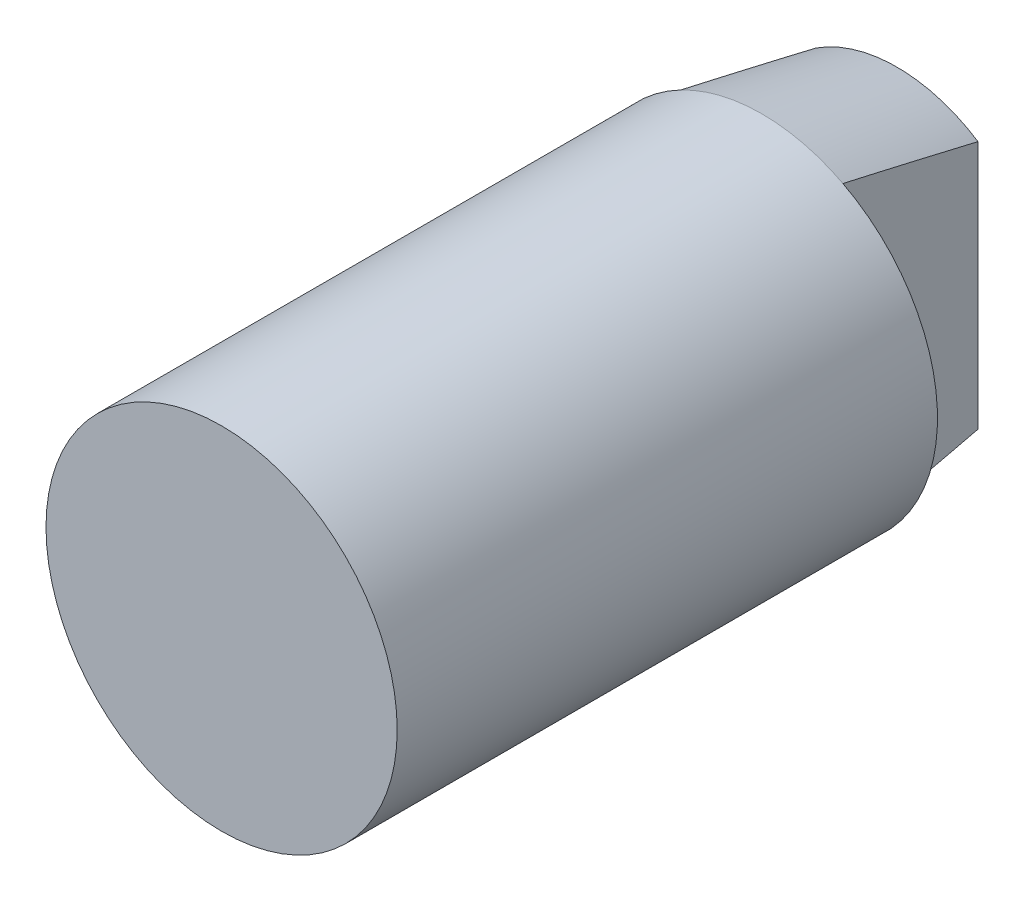
ISO-10303-21;
HEADER;
FILE_DESCRIPTION(('STEP AP214'),'2;1');
FILE_NAME('part.step','',(''),(''),'','','');
FILE_SCHEMA(('AUTOMOTIVE_DESIGN { 1 0 10303 214 1 1 1 1 }'));
ENDSEC;
DATA;
#1=APPLICATION_CONTEXT('core data for automotive mechanical design processes');
#2=APPLICATION_PROTOCOL_DEFINITION('international standard','automotive_design',2000,#1);
#3=PRODUCT_CONTEXT('',#1,'mechanical');
#4=PRODUCT('Part','Part','',(#3));
#5=PRODUCT_RELATED_PRODUCT_CATEGORY('part','',(#4));
#6=PRODUCT_DEFINITION_FORMATION('','',#4);
#7=PRODUCT_DEFINITION_CONTEXT('part definition',#1,'design');
#8=PRODUCT_DEFINITION('design','',#6,#7);
#9=PRODUCT_DEFINITION_SHAPE('','',#8);
#10=(LENGTH_UNIT() NAMED_UNIT(*) SI_UNIT(.MILLI.,.METRE.));
#11=(NAMED_UNIT(*) PLANE_ANGLE_UNIT() SI_UNIT($,.RADIAN.));
#12=(NAMED_UNIT(*) SI_UNIT($,.STERADIAN.) SOLID_ANGLE_UNIT());
#13=UNCERTAINTY_MEASURE_WITH_UNIT(LENGTH_MEASURE(1.E-05),#10,'distance_accuracy_value','');
#14=(GEOMETRIC_REPRESENTATION_CONTEXT(3) GLOBAL_UNCERTAINTY_ASSIGNED_CONTEXT((#13)) GLOBAL_UNIT_ASSIGNED_CONTEXT((#10,
#11,#12)) REPRESENTATION_CONTEXT('',''));
#15=CARTESIAN_POINT('',(0.,0.,0.));
#16=DIRECTION('',(0.,0.,1.));
#17=DIRECTION('',(1.,0.,0.));
#18=AXIS2_PLACEMENT_3D('',#15,#16,#17);
#19=CARTESIAN_POINT('',(0.,0.,-25.));
#20=DIRECTION('',(0.,0.,1.));
#21=DIRECTION('',(0.,-1.,0.));
#22=AXIS2_PLACEMENT_3D('',#19,#20,#21);
#23=CONICAL_SURFACE('',#22,5.5,0.19739555984988);
#24=CARTESIAN_POINT('',(3.,-8.50013025502669,-7.42999491002347));
#25=CARTESIAN_POINT('',(3.,-8.37249752821036,-8.03176121378993));
#26=CARTESIAN_POINT('',(3.,-8.24456666681477,-8.63346441793159));
#27=CARTESIAN_POINT('',(3.,-7.98800297116132,-9.83672611581491));
#28=CARTESIAN_POINT('',(3.,-7.85937013134464,-10.4382846083711));
#29=CARTESIAN_POINT('',(3.,-7.60098752645361,-11.6426797438258));
#30=CARTESIAN_POINT('',(3.,-7.47123581557122,-12.2455159694606));
#31=CARTESIAN_POINT('',(3.,-7.21078824942802,-13.4509799079384));
#32=CARTESIAN_POINT('',(3.,-7.08009240105471,-14.053607622269));
#33=CARTESIAN_POINT('',(3.,-6.81242050683254,-15.2823469894188));
#34=CARTESIAN_POINT('',(3.,-6.67539982292159,-15.9084489237618));
#35=CARTESIAN_POINT('',(3.,-6.3999168910975,-17.1603500624791));
#36=CARTESIAN_POINT('',(3.,-6.26145461188544,-17.7861492599706));
#37=CARTESIAN_POINT('',(3.,-5.98311517017703,-19.0358687482126));
#38=CARTESIAN_POINT('',(3.,-5.84324216362969,-19.6597899637432));
#39=CARTESIAN_POINT('',(3.,-5.5613634865462,-20.9070993672276));
#40=CARTESIAN_POINT('',(3.,-5.41935798470988,-21.5304875932648));
#41=CARTESIAN_POINT('',(3.,-5.13313886120291,-22.7745394523687));
#42=CARTESIAN_POINT('',(3.,-4.98893432634713,-23.3952051722331));
#43=CARTESIAN_POINT('',(3.,-4.6970431359772,-24.6359087146666));
#44=CARTESIAN_POINT('',(3.,-4.54935548111629,-25.255946302465));
#45=CARTESIAN_POINT('',(3.,-4.2483244956615,-26.499530039126));
#46=CARTESIAN_POINT('',(3.,-4.09494729943144,-27.1230680323502));
#47=CARTESIAN_POINT('',(3.,-3.86017163812775,-28.0568511486231));
#48=CARTESIAN_POINT('',(3.,-3.78116992303849,-28.3676988172184));
#49=CARTESIAN_POINT('',(3.,-3.62124735869461,-28.9888909322271));
#50=CARTESIAN_POINT('',(3.,-3.54032656802811,-29.299235393695));
#51=CARTESIAN_POINT('',(3.,-3.37819879363635,-29.9115760900411));
#52=CARTESIAN_POINT('',(3.,-3.29704927139469,-30.2135875094872));
#53=CARTESIAN_POINT('',(3.,-3.13200425658537,-30.8168976928199));
#54=CARTESIAN_POINT('',(3.,-3.048108453833,-31.1181963720548));
#55=CARTESIAN_POINT('',(3.,-2.87653169937902,-31.7209921940999));
#56=CARTESIAN_POINT('',(3.,-2.78883722829909,-32.0224855052024));
#57=CARTESIAN_POINT('',(3.,-2.60896109928571,-32.6240057294026));
#58=CARTESIAN_POINT('',(3.,-2.51678122299014,-32.9240331734783));
#59=CARTESIAN_POINT('',(3.,-2.3277433366787,-33.5177581612623));
#60=CARTESIAN_POINT('',(3.,-2.23097449932199,-33.8114837569221));
#61=CARTESIAN_POINT('',(3.,-2.07942370305196,-34.2501210447855));
#62=CARTESIAN_POINT('',(3.,-2.02779748036241,-34.3961221016273));
#63=CARTESIAN_POINT('',(3.,-1.92193819221734,-34.6871645601825));
#64=CARTESIAN_POINT('',(3.,-1.86770538385696,-34.8322060549416));
#65=CARTESIAN_POINT('',(3.,-1.75634642276511,-35.1200581437644));
#66=CARTESIAN_POINT('',(3.,-1.69924218905475,-35.2628771817046));
#67=CARTESIAN_POINT('',(3.,-1.58087728146268,-35.5467792461856));
#68=CARTESIAN_POINT('',(3.,-1.51961714681276,-35.6878624951509));
#69=CARTESIAN_POINT('',(3.,-1.39166005192237,-35.9671472791625));
#70=CARTESIAN_POINT('',(3.,-1.32497634633541,-36.1053548611872));
#71=CARTESIAN_POINT('',(3.,-1.18381894107563,-36.3777057447354));
#72=CARTESIAN_POINT('',(3.,-1.10935297584445,-36.5118529138548));
#73=CARTESIAN_POINT('',(3.,-1.01293442843886,-36.6682157589198));
#74=CARTESIAN_POINT('',(3.,-0.99672399833831,-36.6939765269612));
#75=CARTESIAN_POINT('',(3.,-0.963767230465193,-36.7451593144079));
#76=CARTESIAN_POINT('',(3.,-0.947020794043688,-36.7705812702233));
#77=CARTESIAN_POINT('',(3.,-0.895885364844914,-36.846288070031));
#78=CARTESIAN_POINT('',(3.,-0.860616568174708,-36.8959871041136));
#79=CARTESIAN_POINT('',(3.,-0.787431758344451,-36.9928962139051));
#80=CARTESIAN_POINT('',(3.,-0.749534857010651,-37.0401206129453));
#81=CARTESIAN_POINT('',(3.,-0.670194036346816,-37.1314711661636));
#82=CARTESIAN_POINT('',(3.,-0.628753701016085,-37.1756003706031));
#83=CARTESIAN_POINT('',(3.,-0.551365796617698,-37.249661566678));
#84=CARTESIAN_POINT('',(3.,-0.516327516415078,-37.2805332287073));
#85=CARTESIAN_POINT('',(3.,-0.443005753284171,-37.3384199185444));
#86=CARTESIAN_POINT('',(3.,-0.404715104209018,-37.3654260585016));
#87=CARTESIAN_POINT('',(3.,-0.324034772968014,-37.4141023755035));
#88=CARTESIAN_POINT('',(3.,-0.281594485714002,-37.4356910935295));
#89=CARTESIAN_POINT('',(3.,-0.193433215111645,-37.4704344885894));
#90=CARTESIAN_POINT('',(3.,-0.147727156044366,-37.4836251064977));
#91=CARTESIAN_POINT('',(3.,-0.0669702137742008,-37.4972377828251));
#92=CARTESIAN_POINT('',(3.,-0.0323354443544674,-37.5001298261094));
#93=CARTESIAN_POINT('',(3.,0.0369239769210836,-37.4998614007246));
#94=CARTESIAN_POINT('',(3.,0.0715486250538797,-37.4966996435582));
#95=CARTESIAN_POINT('',(3.,0.139610698719043,-37.4847276599573));
#96=CARTESIAN_POINT('',(3.,0.173052867797627,-37.4759435813587));
#97=CARTESIAN_POINT('',(3.,0.238296565960294,-37.4536355896972));
#98=CARTESIAN_POINT('',(3.,0.27009691404568,-37.440108317779));
#99=CARTESIAN_POINT('',(3.,0.354196951864254,-37.3981439153295));
#100=CARTESIAN_POINT('',(3.,0.404634439711204,-37.3660090944667));
#101=CARTESIAN_POINT('',(3.,0.500275492943985,-37.2947168916822));
#102=CARTESIAN_POINT('',(3.,0.545458965173375,-37.2555339212573));
#103=CARTESIAN_POINT('',(3.,0.648171241584165,-37.1566906011042));
#104=CARTESIAN_POINT('',(3.,0.703697330016118,-37.094979686022));
#105=CARTESIAN_POINT('',(3.,0.808745100188608,-36.9665805653269));
#106=CARTESIAN_POINT('',(3.,0.858252906690635,-36.899881409954));
#107=CARTESIAN_POINT('',(3.,0.953013584051536,-36.7629656060811));
#108=CARTESIAN_POINT('',(3.,0.998239178685848,-36.6927302737845));
#109=CARTESIAN_POINT('',(3.,1.08512373339213,-36.5502228659717));
#110=CARTESIAN_POINT('',(3.,1.12678669477227,-36.4779531998911));
#111=CARTESIAN_POINT('',(3.,1.21155284090433,-36.3242920822911));
#112=CARTESIAN_POINT('',(3.,1.25435373253929,-36.2427348211706));
#113=CARTESIAN_POINT('',(3.,1.33729771957463,-36.0782745105016));
#114=CARTESIAN_POINT('',(3.,1.3774403978796,-35.9953712522844));
#115=CARTESIAN_POINT('',(3.,1.49470608427746,-35.7450664062881));
#116=CARTESIAN_POINT('',(3.,1.56861729098914,-35.5761626081439));
#117=CARTESIAN_POINT('',(3.,1.71067197353413,-35.2354847576301));
#118=CARTESIAN_POINT('',(3.,1.77880023243294,-35.063704475059));
#119=CARTESIAN_POINT('',(3.,1.9106007784247,-34.7185159923446));
#120=CARTESIAN_POINT('',(3.,1.97427454469298,-34.5451083544887));
#121=CARTESIAN_POINT('',(3.,2.09824137046824,-34.1970008258613));
#122=CARTESIAN_POINT('',(3.,2.15853276167694,-34.0223003446739));
#123=CARTESIAN_POINT('',(3.,2.27640616671523,-33.6719751319493));
#124=CARTESIAN_POINT('',(3.,2.33398796159788,-33.4963503269933));
#125=CARTESIAN_POINT('',(3.,2.44685506744235,-33.1446676540834));
#126=CARTESIAN_POINT('',(3.,2.50214381103605,-32.9686108845931));
#127=CARTESIAN_POINT('',(3.,2.61088904296825,-32.6159400639517));
#128=CARTESIAN_POINT('',(3.,2.66434559034621,-32.4393260309581));
#129=CARTESIAN_POINT('',(3.,2.82136093264928,-31.9123392060175));
#130=CARTESIAN_POINT('',(3.,2.92268136286594,-31.5612994763283));
#131=CARTESIAN_POINT('',(3.,3.12088982536255,-30.8579675903966));
#132=CARTESIAN_POINT('',(3.,3.21777771436916,-30.5056753940667));
#133=CARTESIAN_POINT('',(3.,3.40814346598602,-29.800132732687));
#134=CARTESIAN_POINT('',(3.,3.50162096575764,-29.4468821699451));
#135=CARTESIAN_POINT('',(3.,3.68586418181459,-28.7396735153981));
#136=CARTESIAN_POINT('',(3.,3.77662987563278,-28.385715417757));
#137=CARTESIAN_POINT('',(3.,4.04582408351423,-27.3223797814793));
#138=CARTESIAN_POINT('',(3.,4.22098101581577,-26.6121744774039));
#139=CARTESIAN_POINT('',(3.,4.56530259873549,-25.1903679451379));
#140=CARTESIAN_POINT('',(3.,4.73446761061113,-24.4787668038427));
#141=CARTESIAN_POINT('',(3.,5.06808946209297,-23.0559991163841));
#142=CARTESIAN_POINT('',(3.,5.23255522528944,-22.3448346591525));
#143=CARTESIAN_POINT('',(3.,5.55820941684267,-20.9217461998972));
#144=CARTESIAN_POINT('',(3.,5.71939779590424,-20.2098221866183));
#145=CARTESIAN_POINT('',(3.,6.03917208355685,-18.785639028884));
#146=CARTESIAN_POINT('',(3.,6.19775883887411,-18.0733800743163));
#147=CARTESIAN_POINT('',(3.,6.51290783520697,-16.6484143248361));
#148=CARTESIAN_POINT('',(3.,6.66947007474573,-15.9357075295973));
#149=CARTESIAN_POINT('',(3.,6.96692560353144,-14.574149760008));
#150=CARTESIAN_POINT('',(3.,7.1079599926761,-13.9253295859345));
#151=CARTESIAN_POINT('',(3.,7.38890198700709,-12.6273939766872));
#152=CARTESIAN_POINT('',(3.,7.52880950602538,-11.9782785228695));
#153=CARTESIAN_POINT('',(3.,7.80776333633039,-10.6793771849505));
#154=CARTESIAN_POINT('',(3.,7.94680896035906,-10.0295911533283));
#155=CARTESIAN_POINT('',(3.,8.22406189868126,-8.72989280352999));
#156=CARTESIAN_POINT('',(3.,8.36226927700678,-8.07998049901556));
#157=CARTESIAN_POINT('',(3.,8.50013025502681,-7.4299949100235));
#158=B_SPLINE_CURVE_WITH_KNOTS('',3,(#24,#25,#26,#27,#28,#29,#30,#31,#32,#33,#34,#35,#36,#37,
#38,#39,#40,#41,#42,#43,#44,#45,#46,#47,#48,#49,#50,#51,#52,#53,#54,#55,#56,#57,#58,#59,#60,#61,
#62,#63,#64,#65,#66,#67,#68,#69,#70,#71,#72,#73,#74,#75,#76,#77,#78,#79,#80,#81,#82,#83,#84,#85,
#86,#87,#88,#89,#90,#91,#92,#93,#94,#95,#96,#97,#98,#99,#100,#101,#102,#103,#104,#105,#106,#107,
#108,#109,#110,#111,#112,#113,#114,#115,#116,#117,#118,#119,#120,#121,#122,#123,#124,#125,#126,
#127,#128,#129,#130,#131,#132,#133,#134,#135,#136,#137,#138,#139,#140,#141,#142,#143,#144,#145,
#146,#147,#148,#149,#150,#151,#152,#153,#154,#155,#156,#157),.UNSPECIFIED.,.F.,.F.,(4,2,2,2,2,2,
2,2,2,2,2,2,2,2,2,2,2,2,2,2,2,2,2,2,2,2,2,2,2,2,2,2,2,2,2,2,2,2,2,2,2,2,2,2,2,2,2,2,2,2,2,2,2,2,
2,2,2,2,2,2,2,2,2,2,2,2,4),(0.,1.84545810417472,3.69093084341058,5.54085537312831,
7.39076642120044,9.31352467620037,11.2363247642003,13.1545446751265,15.072613628518,
16.9841988778754,18.8963394203382,20.8226855360176,21.7848699359367,22.7470249987141,
23.6851859608984,24.6234532538591,25.5653897876486,26.5069551833692,27.4346178163574,
27.8991788709874,28.3636941982666,28.8250845614694,29.2864151729472,29.7466503942594,
30.2064324814638,30.2977368822588,30.3890581848482,30.5717946925789,30.7533190428253,
30.9346619145982,31.0745585975572,31.2147719433093,31.3569818964792,31.4985790766184,
31.6023419602212,31.7061269312796,31.8094327005277,31.9128117731843,32.0911776580051,
32.2702046784161,32.5186200735711,32.7675977482294,33.0180674572736,33.2682520560643,
33.5445059921729,33.8208031725705,34.3737127220273,34.928034765353,35.4821718560466,
36.0365799047999,36.5910326754299,37.1446230537103,37.6981955766596,38.7942580260553,
39.8903558785607,40.9865700092008,42.0827932193864,44.2772064487169,46.4714871492127,
48.6612789993173,50.851103761796,53.040201087502,55.2293000100091,57.2212137186051,
59.2132783231481,61.2067671981122,63.2001018262978),.UNSPECIFIED.);
#159=CARTESIAN_POINT('',(3.,-5.76628129733539,-20.));
#160=VERTEX_POINT('',#159);
#161=CARTESIAN_POINT('',(3.,-4.60977222864644,-25.));
#162=VERTEX_POINT('',#161);
#163=EDGE_CURVE('E186',#160,#162,#158,.T.);
#164=ORIENTED_EDGE('',*,*,#163,.F.);
#165=CARTESIAN_POINT('',(0.,0.,-20.));
#166=DIRECTION('',(0.,0.,-1.));
#167=DIRECTION('',(0.,1.,0.));
#168=AXIS2_PLACEMENT_3D('',#165,#166,#167);
#169=CIRCLE('',#168,6.5);
#170=CARTESIAN_POINT('',(-3.,-5.76628129733539,-20.));
#171=VERTEX_POINT('',#170);
#172=EDGE_CURVE('E189',#160,#171,#169,.T.);
#173=ORIENTED_EDGE('',*,*,#172,.T.);
#174=CARTESIAN_POINT('',(-3.,8.50013025502669,-7.42999491002347));
#175=CARTESIAN_POINT('',(-3.,8.37249752821036,-8.03176121378993));
#176=CARTESIAN_POINT('',(-3.,8.24456666681477,-8.63346441793159));
#177=CARTESIAN_POINT('',(-3.,7.98800297116132,-9.83672611581491));
#178=CARTESIAN_POINT('',(-3.,7.85937013134464,-10.4382846083711));
#179=CARTESIAN_POINT('',(-3.,7.60098752645361,-11.6426797438258));
#180=CARTESIAN_POINT('',(-3.,7.47123581557122,-12.2455159694606));
#181=CARTESIAN_POINT('',(-3.,7.21078824942802,-13.4509799079384));
#182=CARTESIAN_POINT('',(-3.,7.08009240105471,-14.053607622269));
#183=CARTESIAN_POINT('',(-3.,6.81242050683254,-15.2823469894188));
#184=CARTESIAN_POINT('',(-3.,6.67539982292159,-15.9084489237618));
#185=CARTESIAN_POINT('',(-3.,6.3999168910975,-17.1603500624791));
#186=CARTESIAN_POINT('',(-3.,6.26145461188544,-17.7861492599706));
#187=CARTESIAN_POINT('',(-3.,5.98311517017703,-19.0358687482126));
#188=CARTESIAN_POINT('',(-3.,5.84324216362969,-19.6597899637432));
#189=CARTESIAN_POINT('',(-3.,5.5613634865462,-20.9070993672276));
#190=CARTESIAN_POINT('',(-3.,5.41935798470988,-21.5304875932648));
#191=CARTESIAN_POINT('',(-3.,5.13313886120291,-22.7745394523687));
#192=CARTESIAN_POINT('',(-3.,4.98893432634713,-23.3952051722331));
#193=CARTESIAN_POINT('',(-3.,4.6970431359772,-24.6359087146666));
#194=CARTESIAN_POINT('',(-3.,4.54935548111629,-25.255946302465));
#195=CARTESIAN_POINT('',(-3.,4.2483244956615,-26.499530039126));
#196=CARTESIAN_POINT('',(-3.,4.09494729943144,-27.1230680323502));
#197=CARTESIAN_POINT('',(-3.,3.86017163812775,-28.0568511486231));
#198=CARTESIAN_POINT('',(-3.,3.78116992303849,-28.3676988172184));
#199=CARTESIAN_POINT('',(-3.,3.62124735869461,-28.9888909322271));
#200=CARTESIAN_POINT('',(-3.,3.54032656802811,-29.299235393695));
#201=CARTESIAN_POINT('',(-3.,3.37819879363635,-29.9115760900411));
#202=CARTESIAN_POINT('',(-3.,3.29704927139469,-30.2135875094872));
#203=CARTESIAN_POINT('',(-3.,3.13200425658537,-30.8168976928199));
#204=CARTESIAN_POINT('',(-3.,3.04810845383301,-31.1181963720548));
#205=CARTESIAN_POINT('',(-3.,2.87653169937902,-31.7209921940999));
#206=CARTESIAN_POINT('',(-3.,2.78883722829909,-32.0224855052024));
#207=CARTESIAN_POINT('',(-3.,2.60896109928571,-32.6240057294026));
#208=CARTESIAN_POINT('',(-3.,2.51678122299014,-32.9240331734783));
#209=CARTESIAN_POINT('',(-3.,2.3277433366787,-33.5177581612623));
#210=CARTESIAN_POINT('',(-3.,2.23097449932199,-33.8114837569221));
#211=CARTESIAN_POINT('',(-3.,2.07942370305196,-34.2501210447855));
#212=CARTESIAN_POINT('',(-3.,2.02779748036241,-34.3961221016273));
#213=CARTESIAN_POINT('',(-3.,1.92193819221734,-34.6871645601825));
#214=CARTESIAN_POINT('',(-3.,1.86770538385696,-34.8322060549416));
#215=CARTESIAN_POINT('',(-3.,1.75634642276511,-35.1200581437644));
#216=CARTESIAN_POINT('',(-3.,1.69924218905475,-35.2628771817046));
#217=CARTESIAN_POINT('',(-3.,1.58087728146268,-35.5467792461856));
#218=CARTESIAN_POINT('',(-3.,1.51961714681276,-35.6878624951509));
#219=CARTESIAN_POINT('',(-3.,1.39166005192237,-35.9671472791625));
#220=CARTESIAN_POINT('',(-3.,1.32497634633541,-36.1053548611872));
#221=CARTESIAN_POINT('',(-3.,1.18381894107563,-36.3777057447354));
#222=CARTESIAN_POINT('',(-3.,1.10935297584445,-36.5118529138548));
#223=CARTESIAN_POINT('',(-3.,1.01293442843886,-36.6682157589198));
#224=CARTESIAN_POINT('',(-3.,0.99672399833831,-36.6939765269612));
#225=CARTESIAN_POINT('',(-3.,0.963767230465194,-36.7451593144079));
#226=CARTESIAN_POINT('',(-3.,0.947020794043689,-36.7705812702233));
#227=CARTESIAN_POINT('',(-3.,0.895885364844915,-36.846288070031));
#228=CARTESIAN_POINT('',(-3.,0.860616568174708,-36.8959871041136));
#229=CARTESIAN_POINT('',(-3.,0.78743175834445,-36.9928962139051));
#230=CARTESIAN_POINT('',(-3.,0.749534857010651,-37.0401206129453));
#231=CARTESIAN_POINT('',(-3.,0.670194036346816,-37.1314711661636));
#232=CARTESIAN_POINT('',(-3.,0.628753701016086,-37.1756003706031));
#233=CARTESIAN_POINT('',(-3.,0.551365796617699,-37.249661566678));
#234=CARTESIAN_POINT('',(-3.,0.516327516415079,-37.2805332287073));
#235=CARTESIAN_POINT('',(-3.,0.443005753284171,-37.3384199185444));
#236=CARTESIAN_POINT('',(-3.,0.404715104209018,-37.3654260585016));
#237=CARTESIAN_POINT('',(-3.,0.324034772968013,-37.4141023755035));
#238=CARTESIAN_POINT('',(-3.,0.281594485714002,-37.4356910935295));
#239=CARTESIAN_POINT('',(-3.,0.193433215111645,-37.4704344885894));
#240=CARTESIAN_POINT('',(-3.,0.147727156044365,-37.4836251064977));
#241=CARTESIAN_POINT('',(-3.,0.0669702137741996,-37.4972377828251));
#242=CARTESIAN_POINT('',(-3.,0.0323354443544665,-37.5001298261094));
#243=CARTESIAN_POINT('',(-3.,-0.0369239769210842,-37.4998614007246));
#244=CARTESIAN_POINT('',(-3.,-0.0715486250538803,-37.4966996435582));
#245=CARTESIAN_POINT('',(-3.,-0.139610698719044,-37.4847276599573));
#246=CARTESIAN_POINT('',(-3.,-0.173052867797628,-37.4759435813587));
#247=CARTESIAN_POINT('',(-3.,-0.238296565960294,-37.4536355896972));
#248=CARTESIAN_POINT('',(-3.,-0.270096914045681,-37.440108317779));
#249=CARTESIAN_POINT('',(-3.,-0.354196951864255,-37.3981439153295));
#250=CARTESIAN_POINT('',(-3.,-0.404634439711206,-37.3660090944667));
#251=CARTESIAN_POINT('',(-3.,-0.500275492943986,-37.2947168916822));
#252=CARTESIAN_POINT('',(-3.,-0.545458965173375,-37.2555339212573));
#253=CARTESIAN_POINT('',(-3.,-0.648171241584162,-37.1566906011042));
#254=CARTESIAN_POINT('',(-3.,-0.703697330016112,-37.094979686022));
#255=CARTESIAN_POINT('',(-3.,-0.808745100188603,-36.9665805653269));
#256=CARTESIAN_POINT('',(-3.,-0.858252906690632,-36.899881409954));
#257=CARTESIAN_POINT('',(-3.,-0.953013584051536,-36.7629656060811));
#258=CARTESIAN_POINT('',(-3.,-0.99823917868585,-36.6927302737845));
#259=CARTESIAN_POINT('',(-3.,-1.08512373339213,-36.5502228659717));
#260=CARTESIAN_POINT('',(-3.,-1.12678669477227,-36.4779531998911));
#261=CARTESIAN_POINT('',(-3.,-1.21155284090433,-36.3242920822911));
#262=CARTESIAN_POINT('',(-3.,-1.25435373253929,-36.2427348211706));
#263=CARTESIAN_POINT('',(-3.,-1.33729771957463,-36.0782745105016));
#264=CARTESIAN_POINT('',(-3.,-1.3774403978796,-35.9953712522844));
#265=CARTESIAN_POINT('',(-3.,-1.49470608427746,-35.7450664062881));
#266=CARTESIAN_POINT('',(-3.,-1.56861729098914,-35.5761626081439));
#267=CARTESIAN_POINT('',(-3.,-1.71067197353412,-35.2354847576301));
#268=CARTESIAN_POINT('',(-3.,-1.77880023243293,-35.063704475059));
#269=CARTESIAN_POINT('',(-3.,-1.9106007784247,-34.7185159923447));
#270=CARTESIAN_POINT('',(-3.,-1.97427454469298,-34.5451083544887));
#271=CARTESIAN_POINT('',(-3.,-2.09824137046824,-34.1970008258613));
#272=CARTESIAN_POINT('',(-3.,-2.15853276167693,-34.0223003446739));
#273=CARTESIAN_POINT('',(-3.,-2.27640616671522,-33.6719751319493));
#274=CARTESIAN_POINT('',(-3.,-2.33398796159788,-33.4963503269933));
#275=CARTESIAN_POINT('',(-3.,-2.44685506744234,-33.1446676540834));
#276=CARTESIAN_POINT('',(-3.,-2.50214381103605,-32.9686108845931));
#277=CARTESIAN_POINT('',(-3.,-2.61088904296825,-32.6159400639517));
#278=CARTESIAN_POINT('',(-3.,-2.66434559034621,-32.4393260309581));
#279=CARTESIAN_POINT('',(-3.,-2.82136093264928,-31.9123392060175));
#280=CARTESIAN_POINT('',(-3.,-2.92268136286593,-31.5612994763283));
#281=CARTESIAN_POINT('',(-3.,-3.12088982536255,-30.8579675903966));
#282=CARTESIAN_POINT('',(-3.,-3.21777771436916,-30.5056753940667));
#283=CARTESIAN_POINT('',(-3.,-3.40814346598602,-29.800132732687));
#284=CARTESIAN_POINT('',(-3.,-3.50162096575764,-29.4468821699451));
#285=CARTESIAN_POINT('',(-3.,-3.68586418181459,-28.7396735153981));
#286=CARTESIAN_POINT('',(-3.,-3.77662987563278,-28.385715417757));
#287=CARTESIAN_POINT('',(-3.,-4.04582408351423,-27.3223797814793));
#288=CARTESIAN_POINT('',(-3.,-4.22098101581577,-26.6121744774039));
#289=CARTESIAN_POINT('',(-3.,-4.56530259873549,-25.1903679451379));
#290=CARTESIAN_POINT('',(-3.,-4.73446761061113,-24.4787668038427));
#291=CARTESIAN_POINT('',(-3.,-5.06808946209297,-23.0559991163841));
#292=CARTESIAN_POINT('',(-3.,-5.23255522528943,-22.3448346591525));
#293=CARTESIAN_POINT('',(-3.,-5.55820941684267,-20.9217461998972));
#294=CARTESIAN_POINT('',(-3.,-5.71939779590423,-20.2098221866183));
#295=CARTESIAN_POINT('',(-3.,-6.03917208355684,-18.785639028884));
#296=CARTESIAN_POINT('',(-3.,-6.19775883887411,-18.0733800743163));
#297=CARTESIAN_POINT('',(-3.,-6.51290783520697,-16.6484143248361));
#298=CARTESIAN_POINT('',(-3.,-6.66947007474572,-15.9357075295973));
#299=CARTESIAN_POINT('',(-3.,-6.96692560353144,-14.574149760008));
#300=CARTESIAN_POINT('',(-3.,-7.10795999267609,-13.9253295859345));
#301=CARTESIAN_POINT('',(-3.,-7.38890198700708,-12.6273939766872));
#302=CARTESIAN_POINT('',(-3.,-7.52880950602538,-11.9782785228695));
#303=CARTESIAN_POINT('',(-3.,-7.80776333633039,-10.6793771849505));
#304=CARTESIAN_POINT('',(-3.,-7.94680896035906,-10.0295911533283));
#305=CARTESIAN_POINT('',(-3.,-8.22406189868126,-8.72989280352999));
#306=CARTESIAN_POINT('',(-3.,-8.36226927700678,-8.07998049901556));
#307=CARTESIAN_POINT('',(-3.,-8.50013025502681,-7.4299949100235));
#308=B_SPLINE_CURVE_WITH_KNOTS('',3,(#174,#175,#176,#177,#178,#179,#180,#181,#182,#183,#184,
#185,#186,#187,#188,#189,#190,#191,#192,#193,#194,#195,#196,#197,#198,#199,#200,#201,#202,#203,
#204,#205,#206,#207,#208,#209,#210,#211,#212,#213,#214,#215,#216,#217,#218,#219,#220,#221,#222,
#223,#224,#225,#226,#227,#228,#229,#230,#231,#232,#233,#234,#235,#236,#237,#238,#239,#240,#241,
#242,#243,#244,#245,#246,#247,#248,#249,#250,#251,#252,#253,#254,#255,#256,#257,#258,#259,#260,
#261,#262,#263,#264,#265,#266,#267,#268,#269,#270,#271,#272,#273,#274,#275,#276,#277,#278,#279,
#280,#281,#282,#283,#284,#285,#286,#287,#288,#289,#290,#291,#292,#293,#294,#295,#296,#297,#298,
#299,#300,#301,#302,#303,#304,#305,#306,#307),.UNSPECIFIED.,.F.,.F.,(4,2,2,2,2,2,2,2,2,2,2,2,2,
2,2,2,2,2,2,2,2,2,2,2,2,2,2,2,2,2,2,2,2,2,2,2,2,2,2,2,2,2,2,2,2,2,2,2,2,2,2,2,2,2,2,2,2,2,2,2,2,
2,2,2,2,2,4),(0.,1.84545810417472,3.69093084341058,5.54085537312831,7.39076642120044,
9.31352467620038,11.2363247642003,13.1545446751265,15.072613628518,16.9841988778754,
18.8963394203382,20.8226855360176,21.7848699359367,22.7470249987141,23.6851859608984,
24.6234532538591,25.5653897876486,26.5069551833692,27.4346178163574,27.8991788709874,
28.3636941982666,28.8250845614694,29.2864151729472,29.7466503942594,30.2064324814638,
30.2977368822588,30.3890581848482,30.5717946925789,30.7533190428253,30.9346619145982,
31.0745585975572,31.2147719433093,31.3569818964792,31.4985790766184,31.6023419602212,
31.7061269312796,31.8094327005277,31.9128117731843,32.0911776580051,32.2702046784161,
32.5186200735711,32.7675977482294,33.0180674572736,33.2682520560643,33.5445059921728,
33.8208031725705,34.3737127220272,34.928034765353,35.4821718560466,36.0365799047998,
36.5910326754299,37.1446230537103,37.6981955766596,38.7942580260553,39.8903558785606,
40.9865700092008,42.0827932193864,44.2772064487168,46.4714871492126,48.6612789993173,
50.851103761796,53.0402010875019,55.2293000100091,57.2212137186051,59.213278323148,
61.2067671981122,63.2001018262978),.UNSPECIFIED.);
#309=CARTESIAN_POINT('',(-3.,-4.60977222864644,-25.));
#310=VERTEX_POINT('',#309);
#311=EDGE_CURVE('E137',#310,#171,#308,.T.);
#312=ORIENTED_EDGE('',*,*,#311,.F.);
#313=CARTESIAN_POINT('',(0.,0.,-25.));
#314=DIRECTION('',(0.,0.,-1.));
#315=DIRECTION('',(0.,1.,0.));
#316=AXIS2_PLACEMENT_3D('',#313,#314,#315);
#317=CIRCLE('',#316,5.5);
#318=EDGE_CURVE('E191',#162,#310,#317,.T.);
#319=ORIENTED_EDGE('',*,*,#318,.F.);
#320=EDGE_LOOP('',(#164,#173,#312,#319));
#321=FACE_BOUND('',#320,.T.);
#322=ADVANCED_FACE('F38',(#321),#23,.T.);
#323=CARTESIAN_POINT('',(0.,0.,0.));
#324=DIRECTION('',(0.,0.,1.));
#325=DIRECTION('',(0.,-1.,0.));
#326=AXIS2_PLACEMENT_3D('',#323,#324,#325);
#327=PLANE('',#326);
#328=CARTESIAN_POINT('',(0.,0.,0.));
#329=DIRECTION('',(0.,0.,-1.));
#330=DIRECTION('',(0.,1.,0.));
#331=AXIS2_PLACEMENT_3D('',#328,#329,#330);
#332=CIRCLE('',#331,6.5);
#333=CARTESIAN_POINT('',(0.,6.5,0.));
#334=VERTEX_POINT('',#333);
#335=EDGE_CURVE('E204',#334,#334,#332,.T.);
#336=ORIENTED_EDGE('',*,*,#335,.F.);
#337=EDGE_LOOP('',(#336));
#338=FACE_BOUND('',#337,.T.);
#339=ADVANCED_FACE('F40',(#338),#327,.T.);
#340=CARTESIAN_POINT('',(0.,0.,-25.));
#341=DIRECTION('',(0.,0.,-1.));
#342=DIRECTION('',(0.,1.,0.));
#343=AXIS2_PLACEMENT_3D('',#340,#341,#342);
#344=CYLINDRICAL_SURFACE('',#343,6.5);
#345=DIRECTION('',(0.,0.,-1.));
#346=VECTOR('',#345,1.);
#347=CARTESIAN_POINT('',(-6.,2.5,-25.));
#348=LINE('',#347,#346);
#349=CARTESIAN_POINT('',(-6.,2.5,-8.));
#350=VERTEX_POINT('',#349);
#351=CARTESIAN_POINT('',(-6.,2.5,-20.));
#352=VERTEX_POINT('',#351);
#353=EDGE_CURVE('E131',#350,#352,#348,.T.);
#354=ORIENTED_EDGE('',*,*,#353,.F.);
#355=CARTESIAN_POINT('',(0.,0.,-8.));
#356=DIRECTION('',(0.,0.,-1.));
#357=DIRECTION('',(-1.,0.,0.));
#358=AXIS2_PLACEMENT_3D('',#355,#356,#357);
#359=CIRCLE('',#358,6.5);
#360=CARTESIAN_POINT('',(-5.99999999999999,-2.5,-8.));
#361=VERTEX_POINT('',#360);
#362=EDGE_CURVE('E11',#350,#361,#359,.F.);
#363=ORIENTED_EDGE('',*,*,#362,.T.);
#364=DIRECTION('',(0.,0.,-1.));
#365=VECTOR('',#364,1.);
#366=CARTESIAN_POINT('',(-5.99999999999999,-2.5,-25.));
#367=LINE('',#366,#365);
#368=CARTESIAN_POINT('',(-5.99999999999999,-2.5,-20.));
#369=VERTEX_POINT('',#368);
#370=EDGE_CURVE('E117',#369,#361,#367,.F.);
#371=ORIENTED_EDGE('',*,*,#370,.F.);
#372=CARTESIAN_POINT('',(0.,0.,-20.));
#373=DIRECTION('',(0.,0.,-1.));
#374=DIRECTION('',(0.,1.,0.));
#375=AXIS2_PLACEMENT_3D('',#372,#373,#374);
#376=CIRCLE('',#375,6.5);
#377=EDGE_CURVE('E139',#171,#369,#376,.T.);
#378=ORIENTED_EDGE('',*,*,#377,.F.);
#379=ORIENTED_EDGE('',*,*,#172,.F.);
#380=CARTESIAN_POINT('',(3.,5.76628129733539,-20.));
#381=VERTEX_POINT('',#380);
#382=EDGE_CURVE('E201',#381,#160,#169,.T.);
#383=ORIENTED_EDGE('',*,*,#382,.F.);
#384=CARTESIAN_POINT('',(-3.,5.76628129733539,-20.));
#385=VERTEX_POINT('',#384);
#386=EDGE_CURVE('E202',#385,#381,#169,.T.);
#387=ORIENTED_EDGE('',*,*,#386,.F.);
#388=EDGE_CURVE('E133',#352,#385,#376,.T.);
#389=ORIENTED_EDGE('',*,*,#388,.F.);
#390=EDGE_LOOP('',(#354,#363,#371,#378,#379,#383,#387,#389));
#391=FACE_BOUND('',#390,.T.);
#392=ORIENTED_EDGE('',*,*,#335,.T.);
#393=EDGE_LOOP('',(#392));
#394=FACE_BOUND('',#393,.T.);
#395=ADVANCED_FACE('F173',(#391,#394),#344,.T.);
#396=CARTESIAN_POINT('',(3.,4.60977222864644,-25.));
#397=VERTEX_POINT('',#396);
#398=EDGE_CURVE('E151',#397,#381,#158,.T.);
#399=ORIENTED_EDGE('',*,*,#398,.F.);
#400=CARTESIAN_POINT('',(-3.,4.60977222864644,-25.));
#401=VERTEX_POINT('',#400);
#402=EDGE_CURVE('E194',#401,#397,#317,.T.);
#403=ORIENTED_EDGE('',*,*,#402,.F.);
#404=EDGE_CURVE('E61',#385,#401,#308,.T.);
#405=ORIENTED_EDGE('',*,*,#404,.F.);
#406=ORIENTED_EDGE('',*,*,#386,.T.);
#407=EDGE_LOOP('',(#399,#403,#405,#406));
#408=FACE_BOUND('',#407,.T.);
#409=ADVANCED_FACE('F158',(#408),#23,.T.);
#410=CARTESIAN_POINT('',(0.,5.5,-25.));
#411=DIRECTION('',(0.,0.,-1.));
#412=DIRECTION('',(0.,1.,0.));
#413=AXIS2_PLACEMENT_3D('',#410,#411,#412);
#414=PLANE('',#413);
#415=DIRECTION('',(0.,1.,0.));
#416=VECTOR('',#415,1.);
#417=CARTESIAN_POINT('',(3.,5.5,-25.));
#418=LINE('',#417,#416);
#419=EDGE_CURVE('E211',#162,#397,#418,.T.);
#420=ORIENTED_EDGE('',*,*,#419,.F.);
#421=ORIENTED_EDGE('',*,*,#318,.T.);
#422=DIRECTION('',(0.,-1.,0.));
#423=VECTOR('',#422,1.);
#424=CARTESIAN_POINT('',(-3.,5.5,-25.));
#425=LINE('',#424,#423);
#426=EDGE_CURVE('E209',#401,#310,#425,.T.);
#427=ORIENTED_EDGE('',*,*,#426,.F.);
#428=ORIENTED_EDGE('',*,*,#402,.T.);
#429=EDGE_LOOP('',(#420,#421,#427,#428));
#430=FACE_BOUND('',#429,.T.);
#431=ADVANCED_FACE('F166',(#430),#414,.T.);
#432=CARTESIAN_POINT('',(-3.,5.76628129733539,-20.));
#433=DIRECTION('',(1.,0.,0.));
#434=DIRECTION('',(0.,0.,-1.));
#435=AXIS2_PLACEMENT_3D('',#432,#433,#434);
#436=PLANE('',#435);
#437=ORIENTED_EDGE('',*,*,#404,.T.);
#438=ORIENTED_EDGE('',*,*,#426,.T.);
#439=ORIENTED_EDGE('',*,*,#311,.T.);
#440=DIRECTION('',(0.,-1.,0.));
#441=VECTOR('',#440,1.);
#442=CARTESIAN_POINT('',(-3.,5.76628129733539,-20.));
#443=LINE('',#442,#441);
#444=EDGE_CURVE('E138',#385,#171,#443,.T.);
#445=ORIENTED_EDGE('',*,*,#444,.F.);
#446=EDGE_LOOP('',(#437,#438,#439,#445));
#447=FACE_BOUND('',#446,.T.);
#448=ADVANCED_FACE('F161',(#447),#436,.F.);
#449=CARTESIAN_POINT('',(0.,0.,-20.));
#450=DIRECTION('',(0.,0.,-1.));
#451=DIRECTION('',(0.,1.,0.));
#452=AXIS2_PLACEMENT_3D('',#449,#450,#451);
#453=PLANE('',#452);
#454=DIRECTION('',(1.,0.,0.));
#455=VECTOR('',#454,1.);
#456=CARTESIAN_POINT('',(0.,2.5,-20.));
#457=LINE('',#456,#455);
#458=CARTESIAN_POINT('',(-3.5,2.5,-20.));
#459=VERTEX_POINT('',#458);
#460=EDGE_CURVE('E46',#352,#459,#457,.T.);
#461=ORIENTED_EDGE('',*,*,#460,.F.);
#462=ORIENTED_EDGE('',*,*,#388,.T.);
#463=ORIENTED_EDGE('',*,*,#444,.T.);
#464=ORIENTED_EDGE('',*,*,#377,.T.);
#465=DIRECTION('',(-1.,0.,0.));
#466=VECTOR('',#465,1.);
#467=CARTESIAN_POINT('',(-9.49999999999999,-2.5,-20.));
#468=LINE('',#467,#466);
#469=CARTESIAN_POINT('',(-3.5,-2.5,-20.));
#470=VERTEX_POINT('',#469);
#471=EDGE_CURVE('E123',#470,#369,#468,.T.);
#472=ORIENTED_EDGE('',*,*,#471,.F.);
#473=DIRECTION('',(0.,-1.,0.));
#474=VECTOR('',#473,1.);
#475=CARTESIAN_POINT('',(-3.5,-2.5,-20.));
#476=LINE('',#475,#474);
#477=EDGE_CURVE('E53',#459,#470,#476,.T.);
#478=ORIENTED_EDGE('',*,*,#477,.F.);
#479=EDGE_LOOP('',(#461,#462,#463,#464,#472,#478));
#480=FACE_BOUND('',#479,.T.);
#481=ADVANCED_FACE('F165',(#480),#453,.T.);
#482=CARTESIAN_POINT('',(3.,5.76628129733539,-20.));
#483=DIRECTION('',(-1.,0.,0.));
#484=DIRECTION('',(0.,0.,1.));
#485=AXIS2_PLACEMENT_3D('',#482,#483,#484);
#486=PLANE('',#485);
#487=ORIENTED_EDGE('',*,*,#163,.T.);
#488=ORIENTED_EDGE('',*,*,#419,.T.);
#489=ORIENTED_EDGE('',*,*,#398,.T.);
#490=DIRECTION('',(0.,1.,0.));
#491=VECTOR('',#490,1.);
#492=CARTESIAN_POINT('',(3.,5.76628129733539,-20.));
#493=LINE('',#492,#491);
#494=EDGE_CURVE('E134',#160,#381,#493,.T.);
#495=ORIENTED_EDGE('',*,*,#494,.F.);
#496=EDGE_LOOP('',(#487,#488,#489,#495));
#497=FACE_BOUND('',#496,.T.);
#498=ADVANCED_FACE('F220',(#497),#486,.F.);
#499=CARTESIAN_POINT('',(0.,0.,-20.));
#500=DIRECTION('',(0.,0.,-1.));
#501=DIRECTION('',(0.,1.,0.));
#502=AXIS2_PLACEMENT_3D('',#499,#500,#501);
#503=PLANE('',#502);
#504=ORIENTED_EDGE('',*,*,#382,.T.);
#505=ORIENTED_EDGE('',*,*,#494,.T.);
#506=EDGE_LOOP('',(#504,#505));
#507=FACE_BOUND('',#506,.T.);
#508=ADVANCED_FACE('F222',(#507),#503,.T.);
#509=CARTESIAN_POINT('',(-3.5,-2.5,-8.));
#510=DIRECTION('',(1.,0.,0.));
#511=DIRECTION('',(0.,0.,-1.));
#512=AXIS2_PLACEMENT_3D('',#509,#510,#511);
#513=PLANE('',#512);
#514=ORIENTED_EDGE('',*,*,#477,.T.);
#515=DIRECTION('',(0.,0.,-1.));
#516=VECTOR('',#515,1.);
#517=CARTESIAN_POINT('',(-3.5,-2.5,-8.));
#518=LINE('',#517,#516);
#519=CARTESIAN_POINT('',(-3.5,-2.5,-8.));
#520=VERTEX_POINT('',#519);
#521=EDGE_CURVE('E103',#520,#470,#518,.T.);
#522=ORIENTED_EDGE('',*,*,#521,.F.);
#523=DIRECTION('',(0.,-1.,0.));
#524=VECTOR('',#523,1.);
#525=CARTESIAN_POINT('',(-3.5,-2.5,-8.));
#526=LINE('',#525,#524);
#527=CARTESIAN_POINT('',(-3.5,2.5,-8.));
#528=VERTEX_POINT('',#527);
#529=EDGE_CURVE('E107',#528,#520,#526,.T.);
#530=ORIENTED_EDGE('',*,*,#529,.F.);
#531=DIRECTION('',(0.,0.,-1.));
#532=VECTOR('',#531,1.);
#533=CARTESIAN_POINT('',(-3.5,2.5,-8.));
#534=LINE('',#533,#532);
#535=EDGE_CURVE('E110',#528,#459,#534,.T.);
#536=ORIENTED_EDGE('',*,*,#535,.T.);
#537=EDGE_LOOP('',(#514,#522,#530,#536));
#538=FACE_BOUND('',#537,.T.);
#539=ADVANCED_FACE('F105',(#538),#513,.F.);
#540=CARTESIAN_POINT('',(-9.49999999999999,2.5,-8.));
#541=DIRECTION('',(0.,1.,0.));
#542=DIRECTION('',(-1.,0.,0.));
#543=AXIS2_PLACEMENT_3D('',#540,#541,#542);
#544=PLANE('',#543);
#545=ORIENTED_EDGE('',*,*,#353,.T.);
#546=ORIENTED_EDGE('',*,*,#460,.T.);
#547=ORIENTED_EDGE('',*,*,#535,.F.);
#548=DIRECTION('',(1.,0.,0.));
#549=VECTOR('',#548,1.);
#550=CARTESIAN_POINT('',(-9.49999999999999,2.5,-8.));
#551=LINE('',#550,#549);
#552=EDGE_CURVE('E111',#350,#528,#551,.T.);
#553=ORIENTED_EDGE('',*,*,#552,.F.);
#554=EDGE_LOOP('',(#545,#546,#547,#553));
#555=FACE_BOUND('',#554,.T.);
#556=ADVANCED_FACE('F214',(#555),#544,.F.);
#557=CARTESIAN_POINT('',(-9.49999999999999,-2.5,-8.));
#558=DIRECTION('',(0.,-1.,0.));
#559=DIRECTION('',(1.,0.,0.));
#560=AXIS2_PLACEMENT_3D('',#557,#558,#559);
#561=PLANE('',#560);
#562=ORIENTED_EDGE('',*,*,#370,.T.);
#563=DIRECTION('',(-1.,0.,0.));
#564=VECTOR('',#563,1.);
#565=CARTESIAN_POINT('',(-9.49999999999999,-2.5,-8.));
#566=LINE('',#565,#564);
#567=EDGE_CURVE('E114',#520,#361,#566,.T.);
#568=ORIENTED_EDGE('',*,*,#567,.F.);
#569=ORIENTED_EDGE('',*,*,#521,.T.);
#570=ORIENTED_EDGE('',*,*,#471,.T.);
#571=EDGE_LOOP('',(#562,#568,#569,#570));
#572=FACE_BOUND('',#571,.T.);
#573=ADVANCED_FACE('F115',(#572),#561,.F.);
#574=CARTESIAN_POINT('',(0.,0.,-8.));
#575=DIRECTION('',(0.,0.,-1.));
#576=DIRECTION('',(-1.,0.,0.));
#577=AXIS2_PLACEMENT_3D('',#574,#575,#576);
#578=PLANE('',#577);
#579=ORIENTED_EDGE('',*,*,#552,.T.);
#580=ORIENTED_EDGE('',*,*,#529,.T.);
#581=ORIENTED_EDGE('',*,*,#567,.T.);
#582=ORIENTED_EDGE('',*,*,#362,.F.);
#583=EDGE_LOOP('',(#579,#580,#581,#582));
#584=FACE_BOUND('',#583,.T.);
#585=ADVANCED_FACE('F120',(#584),#578,.T.);
#586=CLOSED_SHELL('',(#322,#339,#395,#409,#431,#448,#481,#498,#508,#539,#556,#573,#585));
#587=MANIFOLD_SOLID_BREP('B2',#586);
#588=ADVANCED_BREP_SHAPE_REPRESENTATION('',(#18,#587),#14);
#589=SHAPE_DEFINITION_REPRESENTATION(#9,#588);
ENDSEC;
END-ISO-10303-21;
